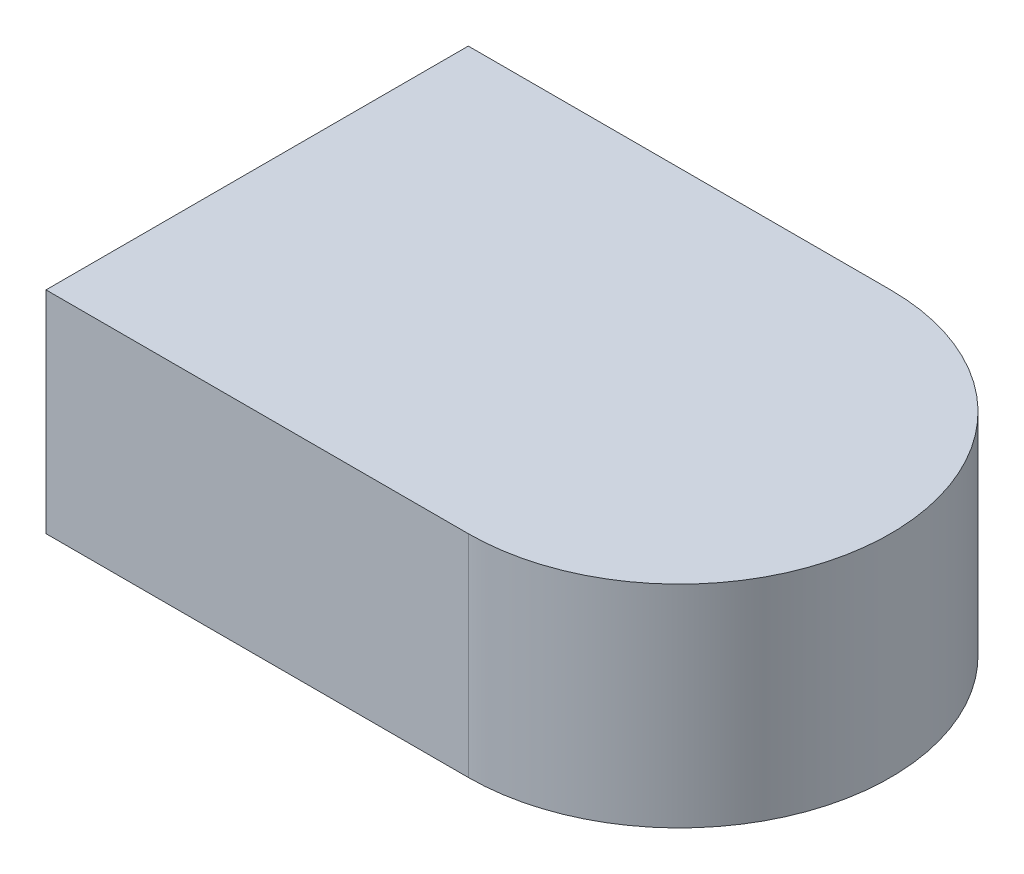
ISO-10303-21;
HEADER;
FILE_DESCRIPTION(('STEP AP214'),'2;1');
FILE_NAME('part.step','',(''),(''),'','','');
FILE_SCHEMA(('AUTOMOTIVE_DESIGN { 1 0 10303 214 1 1 1 1 }'));
ENDSEC;
DATA;
#1=APPLICATION_CONTEXT('core data for automotive mechanical design processes');
#2=APPLICATION_PROTOCOL_DEFINITION('international standard','automotive_design',2000,#1);
#3=PRODUCT_CONTEXT('',#1,'mechanical');
#4=PRODUCT('Part','Part','',(#3));
#5=PRODUCT_RELATED_PRODUCT_CATEGORY('part','',(#4));
#6=PRODUCT_DEFINITION_FORMATION('','',#4);
#7=PRODUCT_DEFINITION_CONTEXT('part definition',#1,'design');
#8=PRODUCT_DEFINITION('design','',#6,#7);
#9=PRODUCT_DEFINITION_SHAPE('','',#8);
#10=(LENGTH_UNIT() NAMED_UNIT(*) SI_UNIT(.MILLI.,.METRE.));
#11=(NAMED_UNIT(*) PLANE_ANGLE_UNIT() SI_UNIT($,.RADIAN.));
#12=(NAMED_UNIT(*) SI_UNIT($,.STERADIAN.) SOLID_ANGLE_UNIT());
#13=UNCERTAINTY_MEASURE_WITH_UNIT(LENGTH_MEASURE(1.E-05),#10,'distance_accuracy_value','');
#14=(GEOMETRIC_REPRESENTATION_CONTEXT(3) GLOBAL_UNCERTAINTY_ASSIGNED_CONTEXT((#13)) GLOBAL_UNIT_ASSIGNED_CONTEXT((#10,
#11,#12)) REPRESENTATION_CONTEXT('',''));
#15=CARTESIAN_POINT('',(0.,0.,0.));
#16=DIRECTION('',(0.,0.,1.));
#17=DIRECTION('',(1.,0.,0.));
#18=AXIS2_PLACEMENT_3D('',#15,#16,#17);
#19=CARTESIAN_POINT('',(0.,0.,0.));
#20=DIRECTION('',(0.,-1.,0.));
#21=DIRECTION('',(-1.,0.,0.));
#22=AXIS2_PLACEMENT_3D('',#19,#20,#21);
#23=PLANE('',#22);
#24=CARTESIAN_POINT('',(-1.05,0.,-1.));
#25=DIRECTION('',(0.,-1.,0.));
#26=DIRECTION('',(0.,0.,-1.));
#27=AXIS2_PLACEMENT_3D('',#24,#25,#26);
#28=CIRCLE('',#27,0.1);
#29=CARTESIAN_POINT('',(-1.05,0.,-1.1));
#30=VERTEX_POINT('',#29);
#31=CARTESIAN_POINT('',(-1.05,0.,-0.9));
#32=VERTEX_POINT('',#31);
#33=EDGE_CURVE('E11',#30,#32,#28,.T.);
#34=ORIENTED_EDGE('',*,*,#33,.T.);
#35=DIRECTION('',(-1.,0.,0.));
#36=VECTOR('',#35,1.);
#37=CARTESIAN_POINT('',(-1.05,0.,-0.9));
#38=LINE('',#37,#36);
#39=CARTESIAN_POINT('',(-1.25,0.,-0.9));
#40=VERTEX_POINT('',#39);
#41=EDGE_CURVE('E25',#32,#40,#38,.T.);
#42=ORIENTED_EDGE('',*,*,#41,.T.);
#43=DIRECTION('',(0.,0.,-1.));
#44=VECTOR('',#43,1.);
#45=CARTESIAN_POINT('',(-1.25,0.,-0.9));
#46=LINE('',#45,#44);
#47=CARTESIAN_POINT('',(-1.25,0.,-1.1));
#48=VERTEX_POINT('',#47);
#49=EDGE_CURVE('E73',#40,#48,#46,.T.);
#50=ORIENTED_EDGE('',*,*,#49,.T.);
#51=DIRECTION('',(1.,0.,0.));
#52=VECTOR('',#51,1.);
#53=CARTESIAN_POINT('',(-1.25,0.,-1.1));
#54=LINE('',#53,#52);
#55=EDGE_CURVE('E99',#48,#30,#54,.T.);
#56=ORIENTED_EDGE('',*,*,#55,.T.);
#57=EDGE_LOOP('',(#34,#42,#50,#56));
#58=FACE_BOUND('',#57,.T.);
#59=ADVANCED_FACE('F17',(#58),#23,.T.);
#60=CARTESIAN_POINT('',(-1.25,0.,-1.1));
#61=DIRECTION('',(0.,0.,1.));
#62=DIRECTION('',(1.,0.,0.));
#63=AXIS2_PLACEMENT_3D('',#60,#61,#62);
#64=PLANE('',#63);
#65=DIRECTION('',(0.,1.,0.));
#66=VECTOR('',#65,1.);
#67=CARTESIAN_POINT('',(-1.25,0.,-1.1));
#68=LINE('',#67,#66);
#69=CARTESIAN_POINT('',(-1.25,0.1,-1.1));
#70=VERTEX_POINT('',#69);
#71=EDGE_CURVE('E95',#48,#70,#68,.T.);
#72=ORIENTED_EDGE('',*,*,#71,.T.);
#73=DIRECTION('',(1.,0.,0.));
#74=VECTOR('',#73,1.);
#75=CARTESIAN_POINT('',(-1.25,0.1,-1.1));
#76=LINE('',#75,#74);
#77=CARTESIAN_POINT('',(-1.05,0.1,-1.1));
#78=VERTEX_POINT('',#77);
#79=EDGE_CURVE('E68',#70,#78,#76,.T.);
#80=ORIENTED_EDGE('',*,*,#79,.T.);
#81=DIRECTION('',(0.,1.,0.));
#82=VECTOR('',#81,1.);
#83=CARTESIAN_POINT('',(-1.05,0.,-1.1));
#84=LINE('',#83,#82);
#85=EDGE_CURVE('E87',#30,#78,#84,.T.);
#86=ORIENTED_EDGE('',*,*,#85,.F.);
#87=ORIENTED_EDGE('',*,*,#55,.F.);
#88=EDGE_LOOP('',(#72,#80,#86,#87));
#89=FACE_BOUND('',#88,.T.);
#90=ADVANCED_FACE('F113',(#89),#64,.F.);
#91=CARTESIAN_POINT('',(-1.05,0.,-1.));
#92=DIRECTION('',(0.,-1.,0.));
#93=DIRECTION('',(-1.,0.,0.));
#94=AXIS2_PLACEMENT_3D('',#91,#92,#93);
#95=CYLINDRICAL_SURFACE('',#94,0.1);
#96=ORIENTED_EDGE('',*,*,#85,.T.);
#97=CARTESIAN_POINT('',(-1.05,0.1,-1.));
#98=DIRECTION('',(0.,-1.,0.));
#99=DIRECTION('',(0.,0.,-1.));
#100=AXIS2_PLACEMENT_3D('',#97,#98,#99);
#101=CIRCLE('',#100,0.1);
#102=CARTESIAN_POINT('',(-1.05,0.1,-0.9));
#103=VERTEX_POINT('',#102);
#104=EDGE_CURVE('E83',#78,#103,#101,.T.);
#105=ORIENTED_EDGE('',*,*,#104,.T.);
#106=DIRECTION('',(0.,1.,0.));
#107=VECTOR('',#106,1.);
#108=CARTESIAN_POINT('',(-1.05,0.,-0.9));
#109=LINE('',#108,#107);
#110=EDGE_CURVE('E60',#32,#103,#109,.T.);
#111=ORIENTED_EDGE('',*,*,#110,.F.);
#112=ORIENTED_EDGE('',*,*,#33,.F.);
#113=EDGE_LOOP('',(#96,#105,#111,#112));
#114=FACE_BOUND('',#113,.T.);
#115=ADVANCED_FACE('F115',(#114),#95,.T.);
#116=CARTESIAN_POINT('',(-1.05,0.,-0.9));
#117=DIRECTION('',(0.,0.,-1.));
#118=DIRECTION('',(-1.,0.,0.));
#119=AXIS2_PLACEMENT_3D('',#116,#117,#118);
#120=PLANE('',#119);
#121=ORIENTED_EDGE('',*,*,#110,.T.);
#122=DIRECTION('',(-1.,0.,0.));
#123=VECTOR('',#122,1.);
#124=CARTESIAN_POINT('',(-1.05,0.1,-0.9));
#125=LINE('',#124,#123);
#126=CARTESIAN_POINT('',(-1.25,0.1,-0.9));
#127=VERTEX_POINT('',#126);
#128=EDGE_CURVE('E53',#103,#127,#125,.T.);
#129=ORIENTED_EDGE('',*,*,#128,.T.);
#130=DIRECTION('',(0.,1.,0.));
#131=VECTOR('',#130,1.);
#132=CARTESIAN_POINT('',(-1.25,0.,-0.9));
#133=LINE('',#132,#131);
#134=EDGE_CURVE('E57',#40,#127,#133,.T.);
#135=ORIENTED_EDGE('',*,*,#134,.F.);
#136=ORIENTED_EDGE('',*,*,#41,.F.);
#137=EDGE_LOOP('',(#121,#129,#135,#136));
#138=FACE_BOUND('',#137,.T.);
#139=ADVANCED_FACE('F55',(#138),#120,.F.);
#140=CARTESIAN_POINT('',(-1.25,0.,-0.9));
#141=DIRECTION('',(1.,0.,0.));
#142=DIRECTION('',(0.,0.,-1.));
#143=AXIS2_PLACEMENT_3D('',#140,#141,#142);
#144=PLANE('',#143);
#145=ORIENTED_EDGE('',*,*,#134,.T.);
#146=DIRECTION('',(0.,0.,-1.));
#147=VECTOR('',#146,1.);
#148=CARTESIAN_POINT('',(-1.25,0.1,-0.9));
#149=LINE('',#148,#147);
#150=EDGE_CURVE('E66',#127,#70,#149,.T.);
#151=ORIENTED_EDGE('',*,*,#150,.T.);
#152=ORIENTED_EDGE('',*,*,#71,.F.);
#153=ORIENTED_EDGE('',*,*,#49,.F.);
#154=EDGE_LOOP('',(#145,#151,#152,#153));
#155=FACE_BOUND('',#154,.T.);
#156=ADVANCED_FACE('F72',(#155),#144,.F.);
#157=CARTESIAN_POINT('',(0.,0.1,0.));
#158=DIRECTION('',(0.,-1.,0.));
#159=DIRECTION('',(-1.,0.,0.));
#160=AXIS2_PLACEMENT_3D('',#157,#158,#159);
#161=PLANE('',#160);
#162=ORIENTED_EDGE('',*,*,#150,.F.);
#163=ORIENTED_EDGE('',*,*,#128,.F.);
#164=ORIENTED_EDGE('',*,*,#104,.F.);
#165=ORIENTED_EDGE('',*,*,#79,.F.);
#166=EDGE_LOOP('',(#162,#163,#164,#165));
#167=FACE_BOUND('',#166,.T.);
#168=ADVANCED_FACE('F67',(#167),#161,.F.);
#169=CLOSED_SHELL('',(#59,#90,#115,#139,#156,#168));
#170=MANIFOLD_SOLID_BREP('B1',#169);
#171=ADVANCED_BREP_SHAPE_REPRESENTATION('',(#18,#170),#14);
#172=SHAPE_DEFINITION_REPRESENTATION(#9,#171);
ENDSEC;
END-ISO-10303-21;
